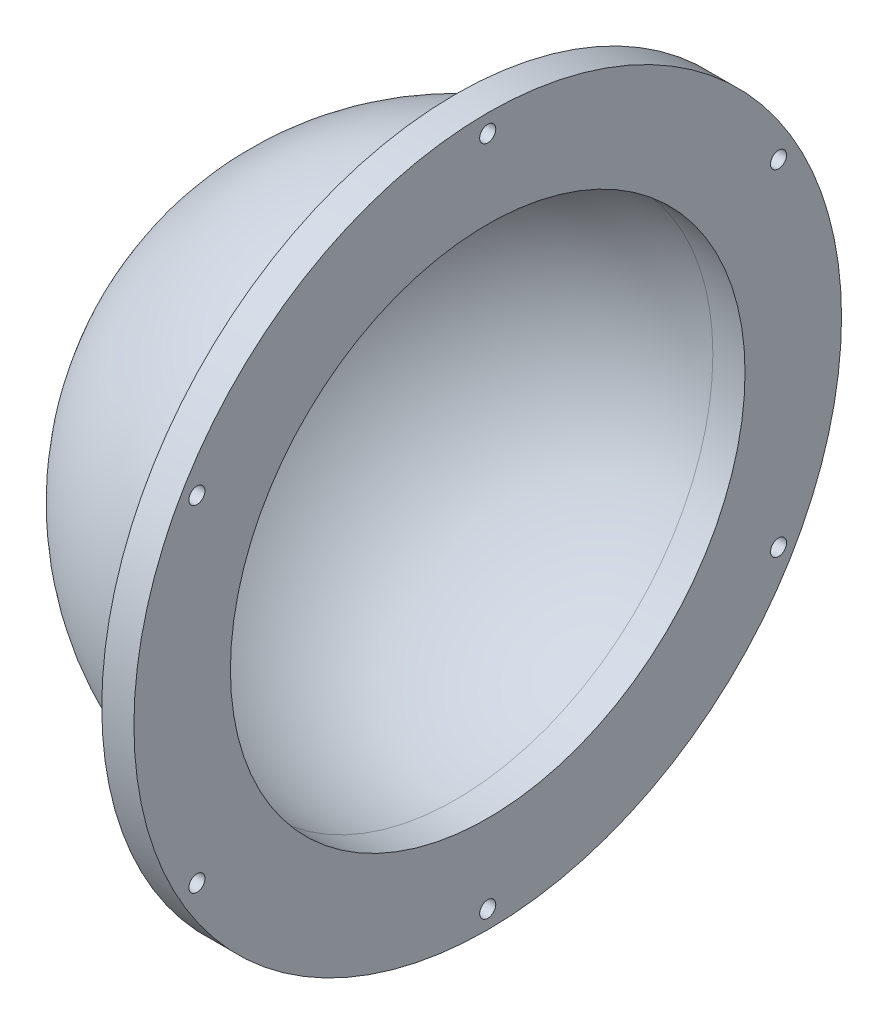
ISO-10303-21;
HEADER;
FILE_DESCRIPTION(('STEP AP214'),'2;1');
FILE_NAME('part.step','',(''),(''),'','','');
FILE_SCHEMA(('AUTOMOTIVE_DESIGN { 1 0 10303 214 1 1 1 1 }'));
ENDSEC;
DATA;
#1=APPLICATION_CONTEXT('core data for automotive mechanical design processes');
#2=APPLICATION_PROTOCOL_DEFINITION('international standard','automotive_design',2000,#1);
#3=PRODUCT_CONTEXT('',#1,'mechanical');
#4=PRODUCT('Part','Part','',(#3));
#5=PRODUCT_RELATED_PRODUCT_CATEGORY('part','',(#4));
#6=PRODUCT_DEFINITION_FORMATION('','',#4);
#7=PRODUCT_DEFINITION_CONTEXT('part definition',#1,'design');
#8=PRODUCT_DEFINITION('design','',#6,#7);
#9=PRODUCT_DEFINITION_SHAPE('','',#8);
#10=(LENGTH_UNIT() NAMED_UNIT(*) SI_UNIT(.MILLI.,.METRE.));
#11=(NAMED_UNIT(*) PLANE_ANGLE_UNIT() SI_UNIT($,.RADIAN.));
#12=(NAMED_UNIT(*) SI_UNIT($,.STERADIAN.) SOLID_ANGLE_UNIT());
#13=UNCERTAINTY_MEASURE_WITH_UNIT(LENGTH_MEASURE(1.E-05),#10,'distance_accuracy_value','');
#14=(GEOMETRIC_REPRESENTATION_CONTEXT(3) GLOBAL_UNCERTAINTY_ASSIGNED_CONTEXT((#13)) GLOBAL_UNIT_ASSIGNED_CONTEXT((#10,
#11,#12)) REPRESENTATION_CONTEXT('',''));
#15=CARTESIAN_POINT('',(0.,0.,0.));
#16=DIRECTION('',(0.,0.,1.));
#17=DIRECTION('',(1.,0.,0.));
#18=AXIS2_PLACEMENT_3D('',#15,#16,#17);
#19=CARTESIAN_POINT('',(-5.,0.,0.));
#20=DIRECTION('',(1.,0.,0.));
#21=DIRECTION('',(0.,0.,-1.));
#22=AXIS2_PLACEMENT_3D('',#19,#20,#21);
#23=SPHERICAL_SURFACE('',#22,45.);
#24=CARTESIAN_POINT('',(-4.99999999999999,0.,0.));
#25=DIRECTION('',(1.,0.,0.));
#26=DIRECTION('',(0.,0.,-1.));
#27=AXIS2_PLACEMENT_3D('',#24,#25,#26);
#28=CIRCLE('',#27,45.);
#29=CARTESIAN_POINT('',(-4.99999999999999,0.,-45.));
#30=VERTEX_POINT('',#29);
#31=EDGE_CURVE('E10',#30,#30,#28,.T.);
#32=ORIENTED_EDGE('',*,*,#31,.F.);
#33=EDGE_LOOP('',(#32));
#34=FACE_BOUND('',#33,.T.);
#35=ADVANCED_FACE('F35',(#34),#23,.T.);
#36=CARTESIAN_POINT('',(-5.,0.,-45.));
#37=DIRECTION('',(-1.,0.,0.));
#38=DIRECTION('',(0.,0.,1.));
#39=AXIS2_PLACEMENT_3D('',#36,#37,#38);
#40=PLANE('',#39);
#41=CARTESIAN_POINT('',(-5.,26.1000000000005,-45.2065260775474));
#42=DIRECTION('',(-1.,0.,0.));
#43=DIRECTION('',(0.,0.866025403784433,0.50000000000001));
#44=AXIS2_PLACEMENT_3D('',#41,#42,#43);
#45=CIRCLE('',#44,1.25);
#46=CARTESIAN_POINT('',(-5.,27.1825317547311,-44.5815260775474));
#47=VERTEX_POINT('',#46);
#48=EDGE_CURVE('E88',#47,#47,#45,.T.);
#49=ORIENTED_EDGE('',*,*,#48,.F.);
#50=EDGE_LOOP('',(#49));
#51=FACE_BOUND('',#50,.T.);
#52=CARTESIAN_POINT('',(-5.,-26.0999999999996,-45.2065260775479));
#53=DIRECTION('',(-1.,0.,0.));
#54=DIRECTION('',(0.,0.866025403784443,-0.499999999999992));
#55=AXIS2_PLACEMENT_3D('',#52,#53,#54);
#56=CIRCLE('',#55,1.25);
#57=CARTESIAN_POINT('',(-5.,-25.017468245269,-45.8315260775479));
#58=VERTEX_POINT('',#57);
#59=EDGE_CURVE('E82',#58,#58,#56,.T.);
#60=ORIENTED_EDGE('',*,*,#59,.F.);
#61=EDGE_LOOP('',(#60));
#62=FACE_BOUND('',#61,.T.);
#63=CARTESIAN_POINT('',(-5.,-52.2,0.));
#64=DIRECTION('',(-1.,0.,0.));
#65=DIRECTION('',(0.,0.,-1.));
#66=AXIS2_PLACEMENT_3D('',#63,#64,#65);
#67=CIRCLE('',#66,1.25);
#68=CARTESIAN_POINT('',(-5.,-52.2,-1.25));
#69=VERTEX_POINT('',#68);
#70=EDGE_CURVE('E76',#69,#69,#67,.T.);
#71=ORIENTED_EDGE('',*,*,#70,.F.);
#72=EDGE_LOOP('',(#71));
#73=FACE_BOUND('',#72,.T.);
#74=CARTESIAN_POINT('',(-5.,-26.1000000000002,45.2065260775476));
#75=DIRECTION('',(-1.,0.,0.));
#76=DIRECTION('',(0.,-0.866025403784436,-0.500000000000004));
#77=AXIS2_PLACEMENT_3D('',#74,#75,#76);
#78=CIRCLE('',#77,1.25);
#79=CARTESIAN_POINT('',(-5.,-27.1825317547308,44.5815260775476));
#80=VERTEX_POINT('',#79);
#81=EDGE_CURVE('E70',#80,#80,#78,.T.);
#82=ORIENTED_EDGE('',*,*,#81,.F.);
#83=EDGE_LOOP('',(#82));
#84=FACE_BOUND('',#83,.T.);
#85=CARTESIAN_POINT('',(-5.,26.0999999999999,45.2065260775478));
#86=DIRECTION('',(-1.,0.,0.));
#87=DIRECTION('',(0.,-0.86602540378444,0.499999999999998));
#88=AXIS2_PLACEMENT_3D('',#85,#86,#87);
#89=CIRCLE('',#88,1.25);
#90=CARTESIAN_POINT('',(-5.,25.0174682452693,45.8315260775478));
#91=VERTEX_POINT('',#90);
#92=EDGE_CURVE('E64',#91,#91,#89,.T.);
#93=ORIENTED_EDGE('',*,*,#92,.F.);
#94=EDGE_LOOP('',(#93));
#95=FACE_BOUND('',#94,.T.);
#96=CARTESIAN_POINT('',(-5.,52.2,0.));
#97=DIRECTION('',(-1.,0.,0.));
#98=DIRECTION('',(0.,0.,1.));
#99=AXIS2_PLACEMENT_3D('',#96,#97,#98);
#100=CIRCLE('',#99,1.25);
#101=CARTESIAN_POINT('',(-5.,52.2,1.25));
#102=VERTEX_POINT('',#101);
#103=EDGE_CURVE('E58',#102,#102,#100,.T.);
#104=ORIENTED_EDGE('',*,*,#103,.F.);
#105=EDGE_LOOP('',(#104));
#106=FACE_BOUND('',#105,.T.);
#107=ORIENTED_EDGE('',*,*,#31,.T.);
#108=EDGE_LOOP('',(#107));
#109=FACE_BOUND('',#108,.T.);
#110=CARTESIAN_POINT('',(-5.,0.,0.));
#111=DIRECTION('',(1.,0.,0.));
#112=DIRECTION('',(0.,0.,-1.));
#113=AXIS2_PLACEMENT_3D('',#110,#111,#112);
#114=CIRCLE('',#113,55.);
#115=CARTESIAN_POINT('',(-5.,0.,-55.));
#116=VERTEX_POINT('',#115);
#117=EDGE_CURVE('E41',#116,#116,#114,.T.);
#118=ORIENTED_EDGE('',*,*,#117,.F.);
#119=EDGE_LOOP('',(#118));
#120=FACE_BOUND('',#119,.T.);
#121=ADVANCED_FACE('F104',(#51,#62,#73,#84,#95,#106,#109,#120),#40,.T.);
#122=CARTESIAN_POINT('',(95.8220155253817,0.,0.));
#123=DIRECTION('',(1.,0.,0.));
#124=DIRECTION('',(0.,0.,-1.));
#125=AXIS2_PLACEMENT_3D('',#122,#123,#124);
#126=CYLINDRICAL_SURFACE('',#125,55.);
#127=ORIENTED_EDGE('',*,*,#117,.T.);
#128=EDGE_LOOP('',(#127));
#129=FACE_BOUND('',#128,.T.);
#130=CARTESIAN_POINT('',(0.,0.,0.));
#131=DIRECTION('',(1.,0.,0.));
#132=DIRECTION('',(0.,0.,-1.));
#133=AXIS2_PLACEMENT_3D('',#130,#131,#132);
#134=CIRCLE('',#133,55.);
#135=CARTESIAN_POINT('',(0.,0.,-55.));
#136=VERTEX_POINT('',#135);
#137=EDGE_CURVE('E45',#136,#136,#134,.T.);
#138=ORIENTED_EDGE('',*,*,#137,.F.);
#139=EDGE_LOOP('',(#138));
#140=FACE_BOUND('',#139,.T.);
#141=ADVANCED_FACE('F107',(#129,#140),#126,.T.);
#142=CARTESIAN_POINT('',(0.,0.,-55.));
#143=DIRECTION('',(1.,0.,0.));
#144=DIRECTION('',(0.,0.,-1.));
#145=AXIS2_PLACEMENT_3D('',#142,#143,#144);
#146=PLANE('',#145);
#147=CARTESIAN_POINT('',(0.,26.1000000000005,-45.2065260775474));
#148=DIRECTION('',(-1.,0.,0.));
#149=DIRECTION('',(0.,0.866025403784433,0.50000000000001));
#150=AXIS2_PLACEMENT_3D('',#147,#148,#149);
#151=CIRCLE('',#150,1.25);
#152=CARTESIAN_POINT('',(0.,27.1825317547311,-44.5815260775474));
#153=VERTEX_POINT('',#152);
#154=EDGE_CURVE('E85',#153,#153,#151,.T.);
#155=ORIENTED_EDGE('',*,*,#154,.T.);
#156=EDGE_LOOP('',(#155));
#157=FACE_BOUND('',#156,.T.);
#158=CARTESIAN_POINT('',(0.,-26.0999999999996,-45.2065260775479));
#159=DIRECTION('',(-1.,0.,0.));
#160=DIRECTION('',(0.,0.866025403784443,-0.499999999999992));
#161=AXIS2_PLACEMENT_3D('',#158,#159,#160);
#162=CIRCLE('',#161,1.25);
#163=CARTESIAN_POINT('',(0.,-25.017468245269,-45.8315260775479));
#164=VERTEX_POINT('',#163);
#165=EDGE_CURVE('E79',#164,#164,#162,.T.);
#166=ORIENTED_EDGE('',*,*,#165,.T.);
#167=EDGE_LOOP('',(#166));
#168=FACE_BOUND('',#167,.T.);
#169=CARTESIAN_POINT('',(0.,-52.2,0.));
#170=DIRECTION('',(-1.,0.,0.));
#171=DIRECTION('',(0.,0.,-1.));
#172=AXIS2_PLACEMENT_3D('',#169,#170,#171);
#173=CIRCLE('',#172,1.25);
#174=CARTESIAN_POINT('',(0.,-52.2,-1.25));
#175=VERTEX_POINT('',#174);
#176=EDGE_CURVE('E73',#175,#175,#173,.T.);
#177=ORIENTED_EDGE('',*,*,#176,.T.);
#178=EDGE_LOOP('',(#177));
#179=FACE_BOUND('',#178,.T.);
#180=CARTESIAN_POINT('',(0.,-26.1000000000002,45.2065260775476));
#181=DIRECTION('',(-1.,0.,0.));
#182=DIRECTION('',(0.,-0.866025403784436,-0.500000000000004));
#183=AXIS2_PLACEMENT_3D('',#180,#181,#182);
#184=CIRCLE('',#183,1.25);
#185=CARTESIAN_POINT('',(0.,-27.1825317547308,44.5815260775476));
#186=VERTEX_POINT('',#185);
#187=EDGE_CURVE('E67',#186,#186,#184,.T.);
#188=ORIENTED_EDGE('',*,*,#187,.T.);
#189=EDGE_LOOP('',(#188));
#190=FACE_BOUND('',#189,.T.);
#191=CARTESIAN_POINT('',(0.,26.0999999999999,45.2065260775478));
#192=DIRECTION('',(-1.,0.,0.));
#193=DIRECTION('',(0.,-0.86602540378444,0.499999999999998));
#194=AXIS2_PLACEMENT_3D('',#191,#192,#193);
#195=CIRCLE('',#194,1.25);
#196=CARTESIAN_POINT('',(0.,25.0174682452693,45.8315260775478));
#197=VERTEX_POINT('',#196);
#198=EDGE_CURVE('E61',#197,#197,#195,.T.);
#199=ORIENTED_EDGE('',*,*,#198,.T.);
#200=EDGE_LOOP('',(#199));
#201=FACE_BOUND('',#200,.T.);
#202=CARTESIAN_POINT('',(0.,52.2,0.));
#203=DIRECTION('',(-1.,0.,0.));
#204=DIRECTION('',(0.,0.,1.));
#205=AXIS2_PLACEMENT_3D('',#202,#203,#204);
#206=CIRCLE('',#205,1.25);
#207=CARTESIAN_POINT('',(0.,52.2,1.25));
#208=VERTEX_POINT('',#207);
#209=EDGE_CURVE('E57',#208,#208,#206,.T.);
#210=ORIENTED_EDGE('',*,*,#209,.T.);
#211=EDGE_LOOP('',(#210));
#212=FACE_BOUND('',#211,.T.);
#213=ORIENTED_EDGE('',*,*,#137,.T.);
#214=EDGE_LOOP('',(#213));
#215=FACE_BOUND('',#214,.T.);
#216=CARTESIAN_POINT('',(0.,0.,0.));
#217=DIRECTION('',(1.,0.,0.));
#218=DIRECTION('',(0.,0.,-1.));
#219=AXIS2_PLACEMENT_3D('',#216,#217,#218);
#220=CIRCLE('',#219,40.);
#221=CARTESIAN_POINT('',(0.,0.,-40.));
#222=VERTEX_POINT('',#221);
#223=EDGE_CURVE('E49',#222,#222,#220,.T.);
#224=ORIENTED_EDGE('',*,*,#223,.F.);
#225=EDGE_LOOP('',(#224));
#226=FACE_BOUND('',#225,.T.);
#227=ADVANCED_FACE('F94',(#157,#168,#179,#190,#201,#212,#215,#226),#146,.T.);
#228=CARTESIAN_POINT('',(95.8220155253817,0.,0.));
#229=DIRECTION('',(1.,0.,0.));
#230=DIRECTION('',(0.,0.,-1.));
#231=AXIS2_PLACEMENT_3D('',#228,#229,#230);
#232=CYLINDRICAL_SURFACE('',#231,40.);
#233=ORIENTED_EDGE('',*,*,#223,.T.);
#234=EDGE_LOOP('',(#233));
#235=FACE_BOUND('',#234,.T.);
#236=CARTESIAN_POINT('',(-5.,0.,0.));
#237=DIRECTION('',(1.,0.,0.));
#238=DIRECTION('',(0.,0.,-1.));
#239=AXIS2_PLACEMENT_3D('',#236,#237,#238);
#240=CIRCLE('',#239,40.);
#241=CARTESIAN_POINT('',(-5.,0.,-40.));
#242=VERTEX_POINT('',#241);
#243=EDGE_CURVE('E54',#242,#242,#240,.T.);
#244=ORIENTED_EDGE('',*,*,#243,.F.);
#245=EDGE_LOOP('',(#244));
#246=FACE_BOUND('',#245,.T.);
#247=ADVANCED_FACE('F132',(#235,#246),#232,.F.);
#248=CARTESIAN_POINT('',(-5.,0.,0.));
#249=DIRECTION('',(1.,0.,0.));
#250=DIRECTION('',(0.,0.,1.));
#251=AXIS2_PLACEMENT_3D('',#248,#249,#250);
#252=SPHERICAL_SURFACE('',#251,40.);
#253=ORIENTED_EDGE('',*,*,#243,.T.);
#254=EDGE_LOOP('',(#253));
#255=FACE_BOUND('',#254,.T.);
#256=ADVANCED_FACE('F122',(#255),#252,.F.);
#257=CARTESIAN_POINT('',(0.,52.2,0.));
#258=DIRECTION('',(-1.,0.,0.));
#259=DIRECTION('',(0.,0.,1.));
#260=AXIS2_PLACEMENT_3D('',#257,#258,#259);
#261=CYLINDRICAL_SURFACE('',#260,1.25);
#262=ORIENTED_EDGE('',*,*,#209,.F.);
#263=EDGE_LOOP('',(#262));
#264=FACE_BOUND('',#263,.T.);
#265=ORIENTED_EDGE('',*,*,#103,.T.);
#266=EDGE_LOOP('',(#265));
#267=FACE_BOUND('',#266,.T.);
#268=ADVANCED_FACE('F119',(#264,#267),#261,.F.);
#269=CARTESIAN_POINT('',(0.,26.0999999999999,45.2065260775478));
#270=DIRECTION('',(-1.,0.,0.));
#271=DIRECTION('',(0.,0.,1.));
#272=AXIS2_PLACEMENT_3D('',#269,#270,#271);
#273=CYLINDRICAL_SURFACE('',#272,1.25);
#274=ORIENTED_EDGE('',*,*,#198,.F.);
#275=EDGE_LOOP('',(#274));
#276=FACE_BOUND('',#275,.T.);
#277=ORIENTED_EDGE('',*,*,#92,.T.);
#278=EDGE_LOOP('',(#277));
#279=FACE_BOUND('',#278,.T.);
#280=ADVANCED_FACE('F121',(#276,#279),#273,.F.);
#281=CARTESIAN_POINT('',(0.,-26.1000000000002,45.2065260775476));
#282=DIRECTION('',(-1.,0.,0.));
#283=DIRECTION('',(0.,0.,1.));
#284=AXIS2_PLACEMENT_3D('',#281,#282,#283);
#285=CYLINDRICAL_SURFACE('',#284,1.25);
#286=ORIENTED_EDGE('',*,*,#187,.F.);
#287=EDGE_LOOP('',(#286));
#288=FACE_BOUND('',#287,.T.);
#289=ORIENTED_EDGE('',*,*,#81,.T.);
#290=EDGE_LOOP('',(#289));
#291=FACE_BOUND('',#290,.T.);
#292=ADVANCED_FACE('F129',(#288,#291),#285,.F.);
#293=CARTESIAN_POINT('',(0.,-52.2,0.));
#294=DIRECTION('',(-1.,0.,0.));
#295=DIRECTION('',(0.,0.,1.));
#296=AXIS2_PLACEMENT_3D('',#293,#294,#295);
#297=CYLINDRICAL_SURFACE('',#296,1.25);
#298=ORIENTED_EDGE('',*,*,#176,.F.);
#299=EDGE_LOOP('',(#298));
#300=FACE_BOUND('',#299,.T.);
#301=ORIENTED_EDGE('',*,*,#70,.T.);
#302=EDGE_LOOP('',(#301));
#303=FACE_BOUND('',#302,.T.);
#304=ADVANCED_FACE('F190',(#300,#303),#297,.F.);
#305=CARTESIAN_POINT('',(0.,-26.0999999999996,-45.2065260775479));
#306=DIRECTION('',(-1.,0.,0.));
#307=DIRECTION('',(0.,0.,1.));
#308=AXIS2_PLACEMENT_3D('',#305,#306,#307);
#309=CYLINDRICAL_SURFACE('',#308,1.25);
#310=ORIENTED_EDGE('',*,*,#165,.F.);
#311=EDGE_LOOP('',(#310));
#312=FACE_BOUND('',#311,.T.);
#313=ORIENTED_EDGE('',*,*,#59,.T.);
#314=EDGE_LOOP('',(#313));
#315=FACE_BOUND('',#314,.T.);
#316=ADVANCED_FACE('F100',(#312,#315),#309,.F.);
#317=CARTESIAN_POINT('',(0.,26.1000000000005,-45.2065260775474));
#318=DIRECTION('',(-1.,0.,0.));
#319=DIRECTION('',(0.,0.,1.));
#320=AXIS2_PLACEMENT_3D('',#317,#318,#319);
#321=CYLINDRICAL_SURFACE('',#320,1.25);
#322=ORIENTED_EDGE('',*,*,#154,.F.);
#323=EDGE_LOOP('',(#322));
#324=FACE_BOUND('',#323,.T.);
#325=ORIENTED_EDGE('',*,*,#48,.T.);
#326=EDGE_LOOP('',(#325));
#327=FACE_BOUND('',#326,.T.);
#328=ADVANCED_FACE('F97',(#324,#327),#321,.F.);
#329=CLOSED_SHELL('',(#35,#121,#141,#227,#247,#256,#268,#280,#292,#304,#316,#328));
#330=MANIFOLD_SOLID_BREP('B2',#329);
#331=ADVANCED_BREP_SHAPE_REPRESENTATION('',(#18,#330),#14);
#332=SHAPE_DEFINITION_REPRESENTATION(#9,#331);
ENDSEC;
END-ISO-10303-21;
